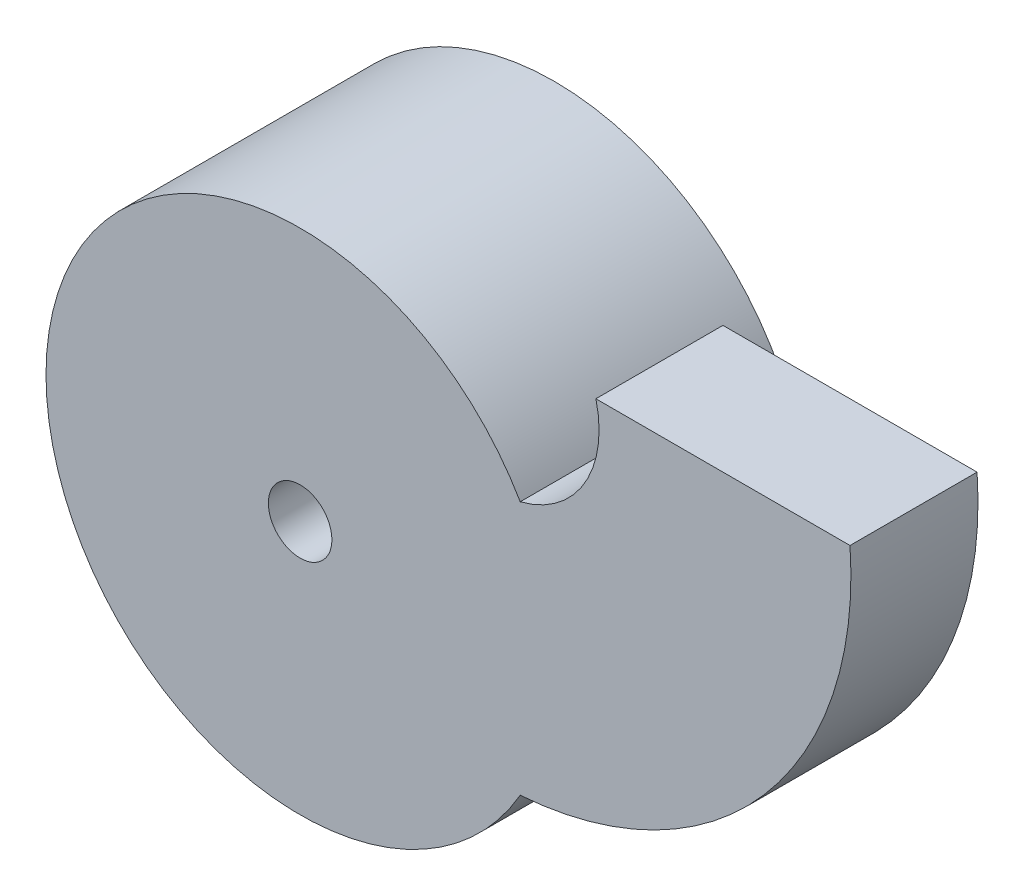
ISO-10303-21;
HEADER;
FILE_DESCRIPTION(('STEP AP214'),'2;1');
FILE_NAME('part.step','',(''),(''),'','','');
FILE_SCHEMA(('AUTOMOTIVE_DESIGN { 1 0 10303 214 1 1 1 1 }'));
ENDSEC;
DATA;
#1=APPLICATION_CONTEXT('core data for automotive mechanical design processes');
#2=APPLICATION_PROTOCOL_DEFINITION('international standard','automotive_design',2000,#1);
#3=PRODUCT_CONTEXT('',#1,'mechanical');
#4=PRODUCT('Part','Part','',(#3));
#5=PRODUCT_RELATED_PRODUCT_CATEGORY('part','',(#4));
#6=PRODUCT_DEFINITION_FORMATION('','',#4);
#7=PRODUCT_DEFINITION_CONTEXT('part definition',#1,'design');
#8=PRODUCT_DEFINITION('design','',#6,#7);
#9=PRODUCT_DEFINITION_SHAPE('','',#8);
#10=(LENGTH_UNIT() NAMED_UNIT(*) SI_UNIT(.MILLI.,.METRE.));
#11=(NAMED_UNIT(*) PLANE_ANGLE_UNIT() SI_UNIT($,.RADIAN.));
#12=(NAMED_UNIT(*) SI_UNIT($,.STERADIAN.) SOLID_ANGLE_UNIT());
#13=UNCERTAINTY_MEASURE_WITH_UNIT(LENGTH_MEASURE(1.E-05),#10,'distance_accuracy_value','');
#14=(GEOMETRIC_REPRESENTATION_CONTEXT(3) GLOBAL_UNCERTAINTY_ASSIGNED_CONTEXT((#13)) GLOBAL_UNIT_ASSIGNED_CONTEXT((#10,
#11,#12)) REPRESENTATION_CONTEXT('',''));
#15=CARTESIAN_POINT('',(0.,0.,0.));
#16=DIRECTION('',(0.,0.,1.));
#17=DIRECTION('',(1.,0.,0.));
#18=AXIS2_PLACEMENT_3D('',#15,#16,#17);
#19=CARTESIAN_POINT('',(-15.9540506372778,-4.04594936272216,20.));
#20=DIRECTION('',(0.,0.,-1.));
#21=DIRECTION('',(-1.,0.,0.));
#22=AXIS2_PLACEMENT_3D('',#19,#20,#21);
#23=PLANE('',#22);
#24=CARTESIAN_POINT('',(-15.9540506372778,-4.04594936272216,20.));
#25=DIRECTION('',(0.,0.,-1.));
#26=DIRECTION('',(-1.,0.,0.));
#27=AXIS2_PLACEMENT_3D('',#24,#25,#26);
#28=CIRCLE('',#27,16.4590837528259);
#29=CARTESIAN_POINT('',(0.,0.,20.));
#30=VERTEX_POINT('',#29);
#31=CARTESIAN_POINT('',(-11.9081012745557,-20.,20.));
#32=VERTEX_POINT('',#31);
#33=EDGE_CURVE('E111',#30,#32,#28,.T.);
#34=ORIENTED_EDGE('',*,*,#33,.T.);
#35=CARTESIAN_POINT('',(-46.5491174259333,-40.,20.));
#36=DIRECTION('',(0.,0.,1.));
#37=DIRECTION('',(1.,0.,0.));
#38=AXIS2_PLACEMENT_3D('',#35,#36,#37);
#39=CIRCLE('',#38,40.);
#40=CARTESIAN_POINT('',(-11.9081012745557,-60.,20.));
#41=VERTEX_POINT('',#40);
#42=EDGE_CURVE('E84',#32,#41,#39,.T.);
#43=ORIENTED_EDGE('',*,*,#42,.T.);
#44=CARTESIAN_POINT('',(-15.9540506372778,-4.04594936272216,20.));
#45=DIRECTION('',(0.,0.,1.));
#46=DIRECTION('',(-1.,0.,0.));
#47=AXIS2_PLACEMENT_3D('',#44,#45,#46);
#48=CIRCLE('',#47,56.1001380476444);
#49=CARTESIAN_POINT('',(40.,0.,20.));
#50=VERTEX_POINT('',#49);
#51=EDGE_CURVE('E116',#41,#50,#48,.T.);
#52=ORIENTED_EDGE('',*,*,#51,.T.);
#53=DIRECTION('',(-1.,0.,0.));
#54=VECTOR('',#53,1.);
#55=CARTESIAN_POINT('',(0.,0.,20.));
#56=LINE('',#55,#54);
#57=EDGE_CURVE('E56',#50,#30,#56,.T.);
#58=ORIENTED_EDGE('',*,*,#57,.T.);
#59=EDGE_LOOP('',(#34,#43,#52,#58));
#60=FACE_BOUND('',#59,.T.);
#61=CARTESIAN_POINT('',(-46.5491174259333,-40.,20.));
#62=DIRECTION('',(0.,0.,1.));
#63=DIRECTION('',(1.,0.,0.));
#64=AXIS2_PLACEMENT_3D('',#61,#62,#63);
#65=CIRCLE('',#64,5.00000000000001);
#66=CARTESIAN_POINT('',(-41.5491174259333,-40.,20.));
#67=VERTEX_POINT('',#66);
#68=EDGE_CURVE('E102',#67,#67,#65,.T.);
#69=ORIENTED_EDGE('',*,*,#68,.F.);
#70=EDGE_LOOP('',(#69));
#71=FACE_BOUND('',#70,.T.);
#72=ADVANCED_FACE('F39',(#60,#71),#23,.F.);
#73=CARTESIAN_POINT('',(-15.9540506372778,-4.04594936272216,0.));
#74=DIRECTION('',(0.,0.,-1.));
#75=DIRECTION('',(-1.,0.,0.));
#76=AXIS2_PLACEMENT_3D('',#73,#74,#75);
#77=PLANE('',#76);
#78=CARTESIAN_POINT('',(-46.5491174259333,-40.,0.));
#79=DIRECTION('',(0.,0.,-1.));
#80=DIRECTION('',(-1.,0.,0.));
#81=AXIS2_PLACEMENT_3D('',#78,#79,#80);
#82=CIRCLE('',#81,40.);
#83=CARTESIAN_POINT('',(-11.9081012745557,-20.,0.));
#84=VERTEX_POINT('',#83);
#85=CARTESIAN_POINT('',(-11.9081012745557,-60.,0.));
#86=VERTEX_POINT('',#85);
#87=EDGE_CURVE('E89',#84,#86,#82,.T.);
#88=ORIENTED_EDGE('',*,*,#87,.F.);
#89=CARTESIAN_POINT('',(-15.9540506372778,-4.04594936272216,0.));
#90=DIRECTION('',(0.,0.,-1.));
#91=DIRECTION('',(-1.,0.,0.));
#92=AXIS2_PLACEMENT_3D('',#89,#90,#91);
#93=CIRCLE('',#92,16.4590837528259);
#94=CARTESIAN_POINT('',(0.,0.,0.));
#95=VERTEX_POINT('',#94);
#96=EDGE_CURVE('E92',#95,#84,#93,.T.);
#97=ORIENTED_EDGE('',*,*,#96,.F.);
#98=DIRECTION('',(-1.,0.,0.));
#99=VECTOR('',#98,1.);
#100=CARTESIAN_POINT('',(0.,0.,0.));
#101=LINE('',#100,#99);
#102=CARTESIAN_POINT('',(40.,0.,0.));
#103=VERTEX_POINT('',#102);
#104=EDGE_CURVE('E77',#103,#95,#101,.T.);
#105=ORIENTED_EDGE('',*,*,#104,.F.);
#106=CARTESIAN_POINT('',(-15.9540506372778,-4.04594936272216,0.));
#107=DIRECTION('',(0.,0.,1.));
#108=DIRECTION('',(-1.,0.,0.));
#109=AXIS2_PLACEMENT_3D('',#106,#107,#108);
#110=CIRCLE('',#109,56.1001380476444);
#111=EDGE_CURVE('E71',#86,#103,#110,.T.);
#112=ORIENTED_EDGE('',*,*,#111,.F.);
#113=EDGE_LOOP('',(#88,#97,#105,#112));
#114=FACE_BOUND('',#113,.T.);
#115=ADVANCED_FACE('F90',(#114),#77,.T.);
#116=CARTESIAN_POINT('',(-15.9540506372778,-4.04594936272216,20.));
#117=DIRECTION('',(0.,0.,-1.));
#118=DIRECTION('',(-1.,0.,0.));
#119=AXIS2_PLACEMENT_3D('',#116,#117,#118);
#120=CYLINDRICAL_SURFACE('',#119,16.4590837528259);
#121=ORIENTED_EDGE('',*,*,#96,.T.);
#122=DIRECTION('',(0.,0.,-1.));
#123=VECTOR('',#122,1.);
#124=CARTESIAN_POINT('',(-11.9081012745557,-20.,20.));
#125=LINE('',#124,#123);
#126=EDGE_CURVE('E12',#32,#84,#125,.T.);
#127=ORIENTED_EDGE('',*,*,#126,.F.);
#128=ORIENTED_EDGE('',*,*,#33,.F.);
#129=DIRECTION('',(0.,0.,-1.));
#130=VECTOR('',#129,1.);
#131=CARTESIAN_POINT('',(0.,0.,20.));
#132=LINE('',#131,#130);
#133=EDGE_CURVE('E101',#30,#95,#132,.T.);
#134=ORIENTED_EDGE('',*,*,#133,.T.);
#135=EDGE_LOOP('',(#121,#127,#128,#134));
#136=FACE_BOUND('',#135,.T.);
#137=ADVANCED_FACE('F41',(#136),#120,.F.);
#138=CARTESIAN_POINT('',(-46.5491174259333,-40.,20.));
#139=DIRECTION('',(0.,0.,-1.));
#140=DIRECTION('',(-1.,0.,0.));
#141=AXIS2_PLACEMENT_3D('',#138,#139,#140);
#142=CYLINDRICAL_SURFACE('',#141,40.);
#143=ORIENTED_EDGE('',*,*,#126,.T.);
#144=ORIENTED_EDGE('',*,*,#87,.T.);
#145=DIRECTION('',(0.,0.,-1.));
#146=VECTOR('',#145,1.);
#147=CARTESIAN_POINT('',(-11.9081012745557,-60.,20.));
#148=LINE('',#147,#146);
#149=EDGE_CURVE('E48',#41,#86,#148,.T.);
#150=ORIENTED_EDGE('',*,*,#149,.F.);
#151=ORIENTED_EDGE('',*,*,#42,.F.);
#152=EDGE_LOOP('',(#143,#144,#150,#151));
#153=FACE_BOUND('',#152,.T.);
#154=CARTESIAN_POINT('',(-46.5491174259333,-40.,-20.));
#155=DIRECTION('',(0.,0.,-1.));
#156=DIRECTION('',(-1.,0.,0.));
#157=AXIS2_PLACEMENT_3D('',#154,#155,#156);
#158=CIRCLE('',#157,40.);
#159=CARTESIAN_POINT('',(-86.5491174259333,-40.,-20.));
#160=VERTEX_POINT('',#159);
#161=EDGE_CURVE('E93',#160,#160,#158,.T.);
#162=ORIENTED_EDGE('',*,*,#161,.F.);
#163=EDGE_LOOP('',(#162));
#164=FACE_BOUND('',#163,.T.);
#165=ADVANCED_FACE('F97',(#153,#164),#142,.T.);
#166=CARTESIAN_POINT('',(-15.9540506372778,-4.04594936272216,20.));
#167=DIRECTION('',(0.,0.,-1.));
#168=DIRECTION('',(-1.,0.,0.));
#169=AXIS2_PLACEMENT_3D('',#166,#167,#168);
#170=CYLINDRICAL_SURFACE('',#169,56.1001380476444);
#171=ORIENTED_EDGE('',*,*,#111,.T.);
#172=DIRECTION('',(0.,0.,-1.));
#173=VECTOR('',#172,1.);
#174=CARTESIAN_POINT('',(40.,0.,20.));
#175=LINE('',#174,#173);
#176=EDGE_CURVE('E113',#50,#103,#175,.T.);
#177=ORIENTED_EDGE('',*,*,#176,.F.);
#178=ORIENTED_EDGE('',*,*,#51,.F.);
#179=ORIENTED_EDGE('',*,*,#149,.T.);
#180=EDGE_LOOP('',(#171,#177,#178,#179));
#181=FACE_BOUND('',#180,.T.);
#182=ADVANCED_FACE('F115',(#181),#170,.T.);
#183=CARTESIAN_POINT('',(0.,0.,20.));
#184=DIRECTION('',(0.,-1.,0.));
#185=DIRECTION('',(1.,0.,0.));
#186=AXIS2_PLACEMENT_3D('',#183,#184,#185);
#187=PLANE('',#186);
#188=ORIENTED_EDGE('',*,*,#104,.T.);
#189=ORIENTED_EDGE('',*,*,#133,.F.);
#190=ORIENTED_EDGE('',*,*,#57,.F.);
#191=ORIENTED_EDGE('',*,*,#176,.T.);
#192=EDGE_LOOP('',(#188,#189,#190,#191));
#193=FACE_BOUND('',#192,.T.);
#194=ADVANCED_FACE('F134',(#193),#187,.F.);
#195=CARTESIAN_POINT('',(-46.5491174259333,-40.,20.));
#196=DIRECTION('',(0.,0.,-1.));
#197=DIRECTION('',(-1.,0.,0.));
#198=AXIS2_PLACEMENT_3D('',#195,#196,#197);
#199=CYLINDRICAL_SURFACE('',#198,5.00000000000001);
#200=ORIENTED_EDGE('',*,*,#68,.T.);
#201=EDGE_LOOP('',(#200));
#202=FACE_BOUND('',#201,.T.);
#203=CARTESIAN_POINT('',(-46.5491174259333,-40.,-20.));
#204=DIRECTION('',(0.,0.,-1.));
#205=DIRECTION('',(-1.,0.,0.));
#206=AXIS2_PLACEMENT_3D('',#203,#204,#205);
#207=CIRCLE('',#206,5.);
#208=CARTESIAN_POINT('',(-51.5491174259333,-40.,-20.));
#209=VERTEX_POINT('',#208);
#210=EDGE_CURVE('E94',#209,#209,#207,.T.);
#211=ORIENTED_EDGE('',*,*,#210,.T.);
#212=EDGE_LOOP('',(#211));
#213=FACE_BOUND('',#212,.T.);
#214=ADVANCED_FACE('F125',(#202,#213),#199,.F.);
#215=CARTESIAN_POINT('',(-46.5491174259333,-40.,-20.));
#216=DIRECTION('',(0.,0.,-1.));
#217=DIRECTION('',(-1.,0.,0.));
#218=AXIS2_PLACEMENT_3D('',#215,#216,#217);
#219=PLANE('',#218);
#220=ORIENTED_EDGE('',*,*,#161,.T.);
#221=EDGE_LOOP('',(#220));
#222=FACE_BOUND('',#221,.T.);
#223=ORIENTED_EDGE('',*,*,#210,.F.);
#224=EDGE_LOOP('',(#223));
#225=FACE_BOUND('',#224,.T.);
#226=ADVANCED_FACE('F127',(#222,#225),#219,.T.);
#227=CLOSED_SHELL('',(#72,#115,#137,#165,#182,#194,#214,#226));
#228=MANIFOLD_SOLID_BREP('B2',#227);
#229=ADVANCED_BREP_SHAPE_REPRESENTATION('',(#18,#228),#14);
#230=SHAPE_DEFINITION_REPRESENTATION(#9,#229);
ENDSEC;
END-ISO-10303-21;
